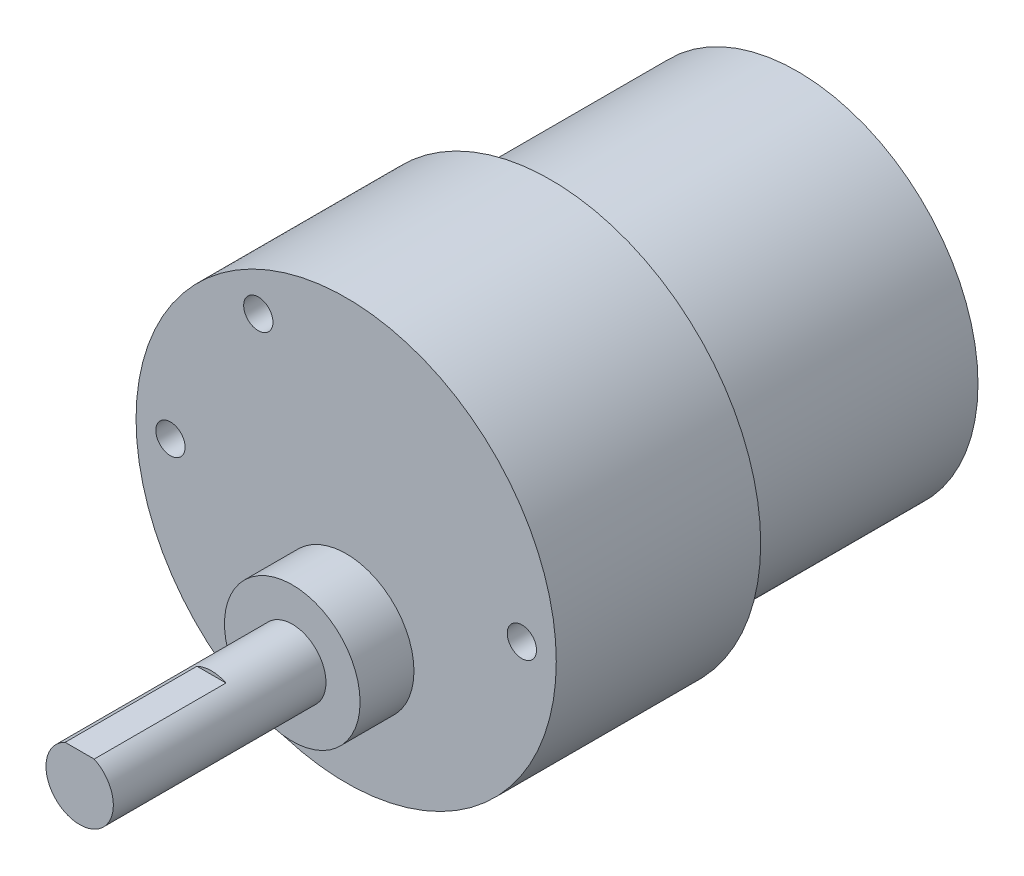
ISO-10303-21;
HEADER;
FILE_DESCRIPTION(('STEP AP214'),'2;1');
FILE_NAME('part.step','',(''),(''),'','','');
FILE_SCHEMA(('AUTOMOTIVE_DESIGN { 1 0 10303 214 1 1 1 1 }'));
ENDSEC;
DATA;
#1=APPLICATION_CONTEXT('core data for automotive mechanical design processes');
#2=APPLICATION_PROTOCOL_DEFINITION('international standard','automotive_design',2000,#1);
#3=PRODUCT_CONTEXT('',#1,'mechanical');
#4=PRODUCT('Part','Part','',(#3));
#5=PRODUCT_RELATED_PRODUCT_CATEGORY('part','',(#4));
#6=PRODUCT_DEFINITION_FORMATION('','',#4);
#7=PRODUCT_DEFINITION_CONTEXT('part definition',#1,'design');
#8=PRODUCT_DEFINITION('design','',#6,#7);
#9=PRODUCT_DEFINITION_SHAPE('','',#8);
#10=(LENGTH_UNIT() NAMED_UNIT(*) SI_UNIT(.MILLI.,.METRE.));
#11=(NAMED_UNIT(*) PLANE_ANGLE_UNIT() SI_UNIT($,.RADIAN.));
#12=(NAMED_UNIT(*) SI_UNIT($,.STERADIAN.) SOLID_ANGLE_UNIT());
#13=UNCERTAINTY_MEASURE_WITH_UNIT(LENGTH_MEASURE(1.E-05),#10,'distance_accuracy_value','');
#14=(GEOMETRIC_REPRESENTATION_CONTEXT(3) GLOBAL_UNCERTAINTY_ASSIGNED_CONTEXT((#13)) GLOBAL_UNIT_ASSIGNED_CONTEXT((#10,
#11,#12)) REPRESENTATION_CONTEXT('',''));
#15=CARTESIAN_POINT('',(0.,0.,0.));
#16=DIRECTION('',(0.,0.,1.));
#17=DIRECTION('',(1.,0.,0.));
#18=AXIS2_PLACEMENT_3D('',#15,#16,#17);
#19=CARTESIAN_POINT('',(0.,0.,0.));
#20=DIRECTION('',(0.,0.,1.));
#21=DIRECTION('',(1.,0.,0.));
#22=AXIS2_PLACEMENT_3D('',#19,#20,#21);
#23=PLANE('',#22);
#24=CARTESIAN_POINT('',(0.,0.,0.));
#25=DIRECTION('',(0.,0.,1.));
#26=DIRECTION('',(1.,0.,0.));
#27=AXIS2_PLACEMENT_3D('',#24,#25,#26);
#28=CIRCLE('',#27,15.6591);
#29=CARTESIAN_POINT('',(15.6591,0.,0.));
#30=VERTEX_POINT('',#29);
#31=EDGE_CURVE('E92',#30,#30,#28,.T.);
#32=ORIENTED_EDGE('',*,*,#31,.F.);
#33=EDGE_LOOP('',(#32));
#34=FACE_BOUND('',#33,.T.);
#35=CARTESIAN_POINT('',(0.,0.,0.));
#36=DIRECTION('',(0.,0.,1.));
#37=DIRECTION('',(1.,0.,0.));
#38=AXIS2_PLACEMENT_3D('',#35,#36,#37);
#39=CIRCLE('',#38,4.4577);
#40=CARTESIAN_POINT('',(4.4577,0.,0.));
#41=VERTEX_POINT('',#40);
#42=EDGE_CURVE('E11',#41,#41,#39,.F.);
#43=ORIENTED_EDGE('',*,*,#42,.F.);
#44=EDGE_LOOP('',(#43));
#45=FACE_BOUND('',#44,.T.);
#46=ADVANCED_FACE('F32',(#34,#45),#23,.F.);
#47=CARTESIAN_POINT('',(0.,-6.8834,43.815));
#48=DIRECTION('',(0.,0.,1.));
#49=DIRECTION('',(1.,0.,0.));
#50=AXIS2_PLACEMENT_3D('',#47,#48,#49);
#51=PLANE('',#50);
#52=CARTESIAN_POINT('',(0.,-6.8834,43.815));
#53=DIRECTION('',(0.,0.,1.));
#54=DIRECTION('',(1.,0.,0.));
#55=AXIS2_PLACEMENT_3D('',#52,#53,#54);
#56=CIRCLE('',#55,5.8801);
#57=CARTESIAN_POINT('',(5.8801,-6.8834,43.815));
#58=VERTEX_POINT('',#57);
#59=EDGE_CURVE('E77',#58,#58,#56,.T.);
#60=ORIENTED_EDGE('',*,*,#59,.T.);
#61=EDGE_LOOP('',(#60));
#62=FACE_BOUND('',#61,.T.);
#63=CARTESIAN_POINT('',(0.,-6.8834,43.815));
#64=DIRECTION('',(0.,0.,1.));
#65=DIRECTION('',(1.,0.,0.));
#66=AXIS2_PLACEMENT_3D('',#63,#64,#65);
#67=CIRCLE('',#66,2.921);
#68=CARTESIAN_POINT('',(2.921,-6.8834,43.815));
#69=VERTEX_POINT('',#68);
#70=EDGE_CURVE('E74',#69,#69,#67,.T.);
#71=ORIENTED_EDGE('',*,*,#70,.F.);
#72=EDGE_LOOP('',(#71));
#73=FACE_BOUND('',#72,.T.);
#74=ADVANCED_FACE('F106',(#62,#73),#51,.T.);
#75=CARTESIAN_POINT('',(0.,0.,39.1414));
#76=DIRECTION('',(0.,0.,1.));
#77=DIRECTION('',(1.,0.,0.));
#78=AXIS2_PLACEMENT_3D('',#75,#76,#77);
#79=PLANE('',#78);
#80=CARTESIAN_POINT('',(-7.61999995005214,13.1982271825123,39.1414));
#81=DIRECTION('',(0.,0.,1.));
#82=DIRECTION('',(1.,0.,0.));
#83=AXIS2_PLACEMENT_3D('',#80,#81,#82);
#84=CIRCLE('',#83,1.27);
#85=CARTESIAN_POINT('',(-6.34999995005214,13.1982271825123,39.1414));
#86=VERTEX_POINT('',#85);
#87=EDGE_CURVE('E275',#86,#86,#84,.T.);
#88=ORIENTED_EDGE('',*,*,#87,.F.);
#89=EDGE_LOOP('',(#88));
#90=FACE_BOUND('',#89,.T.);
#91=CARTESIAN_POINT('',(-7.62000000000006,-13.198227096,39.1414));
#92=DIRECTION('',(0.,0.,1.));
#93=DIRECTION('',(1.,0.,0.));
#94=AXIS2_PLACEMENT_3D('',#91,#92,#93);
#95=CIRCLE('',#94,1.27);
#96=CARTESIAN_POINT('',(-6.35000000000006,-13.198227096,39.1414));
#97=VERTEX_POINT('',#96);
#98=EDGE_CURVE('E281',#97,#97,#95,.T.);
#99=ORIENTED_EDGE('',*,*,#98,.F.);
#100=EDGE_LOOP('',(#99));
#101=FACE_BOUND('',#100,.T.);
#102=CARTESIAN_POINT('',(-15.24,0.,39.1414));
#103=DIRECTION('',(0.,0.,1.));
#104=DIRECTION('',(1.,0.,0.));
#105=AXIS2_PLACEMENT_3D('',#102,#103,#104);
#106=CIRCLE('',#105,1.27);
#107=CARTESIAN_POINT('',(-13.97,0.,39.1414));
#108=VERTEX_POINT('',#107);
#109=EDGE_CURVE('E287',#108,#108,#106,.T.);
#110=ORIENTED_EDGE('',*,*,#109,.F.);
#111=EDGE_LOOP('',(#110));
#112=FACE_BOUND('',#111,.T.);
#113=CARTESIAN_POINT('',(15.24,0.,39.1414));
#114=DIRECTION('',(0.,0.,1.));
#115=DIRECTION('',(1.,0.,0.));
#116=AXIS2_PLACEMENT_3D('',#113,#114,#115);
#117=CIRCLE('',#116,1.27);
#118=CARTESIAN_POINT('',(16.51,0.,39.1414));
#119=VERTEX_POINT('',#118);
#120=EDGE_CURVE('E293',#119,#119,#117,.T.);
#121=ORIENTED_EDGE('',*,*,#120,.F.);
#122=EDGE_LOOP('',(#121));
#123=FACE_BOUND('',#122,.T.);
#124=CARTESIAN_POINT('',(0.,0.,39.1414));
#125=DIRECTION('',(0.,0.,1.));
#126=DIRECTION('',(1.,0.,0.));
#127=AXIS2_PLACEMENT_3D('',#124,#125,#126);
#128=CIRCLE('',#127,18.2245);
#129=CARTESIAN_POINT('',(18.2245,0.,39.1414));
#130=VERTEX_POINT('',#129);
#131=EDGE_CURVE('E89',#130,#130,#128,.T.);
#132=ORIENTED_EDGE('',*,*,#131,.T.);
#133=EDGE_LOOP('',(#132));
#134=FACE_BOUND('',#133,.T.);
#135=CARTESIAN_POINT('',(0.,-6.8834,39.1414));
#136=DIRECTION('',(0.,0.,1.));
#137=DIRECTION('',(1.,0.,0.));
#138=AXIS2_PLACEMENT_3D('',#135,#136,#137);
#139=CIRCLE('',#138,5.8801);
#140=CARTESIAN_POINT('',(5.8801,-6.8834,39.1414));
#141=VERTEX_POINT('',#140);
#142=EDGE_CURVE('E73',#141,#141,#139,.T.);
#143=ORIENTED_EDGE('',*,*,#142,.F.);
#144=EDGE_LOOP('',(#143));
#145=FACE_BOUND('',#144,.T.);
#146=ADVANCED_FACE('F101',(#90,#101,#112,#123,#134,#145),#79,.T.);
#147=CARTESIAN_POINT('',(0.,0.,21.4122));
#148=DIRECTION('',(0.,0.,-1.));
#149=DIRECTION('',(-1.,0.,0.));
#150=AXIS2_PLACEMENT_3D('',#147,#148,#149);
#151=CYLINDRICAL_SURFACE('',#150,15.6591);
#152=CARTESIAN_POINT('',(0.,0.,21.4122));
#153=DIRECTION('',(0.,0.,1.));
#154=DIRECTION('',(1.,0.,0.));
#155=AXIS2_PLACEMENT_3D('',#152,#153,#154);
#156=CIRCLE('',#155,15.6591);
#157=CARTESIAN_POINT('',(15.6591,0.,21.4122));
#158=VERTEX_POINT('',#157);
#159=EDGE_CURVE('E40',#158,#158,#156,.T.);
#160=ORIENTED_EDGE('',*,*,#159,.F.);
#161=EDGE_LOOP('',(#160));
#162=FACE_BOUND('',#161,.T.);
#163=ORIENTED_EDGE('',*,*,#31,.T.);
#164=EDGE_LOOP('',(#163));
#165=FACE_BOUND('',#164,.T.);
#166=ADVANCED_FACE('F34',(#162,#165),#151,.T.);
#167=CARTESIAN_POINT('',(0.,0.,21.4122));
#168=DIRECTION('',(0.,0.,1.));
#169=DIRECTION('',(1.,0.,0.));
#170=AXIS2_PLACEMENT_3D('',#167,#168,#169);
#171=PLANE('',#170);
#172=CARTESIAN_POINT('',(0.,0.,21.4122));
#173=DIRECTION('',(0.,0.,1.));
#174=DIRECTION('',(1.,0.,0.));
#175=AXIS2_PLACEMENT_3D('',#172,#173,#174);
#176=CIRCLE('',#175,18.2245);
#177=CARTESIAN_POINT('',(18.2245,0.,21.4122));
#178=VERTEX_POINT('',#177);
#179=EDGE_CURVE('E86',#178,#178,#176,.T.);
#180=ORIENTED_EDGE('',*,*,#179,.F.);
#181=EDGE_LOOP('',(#180));
#182=FACE_BOUND('',#181,.T.);
#183=ORIENTED_EDGE('',*,*,#159,.T.);
#184=EDGE_LOOP('',(#183));
#185=FACE_BOUND('',#184,.T.);
#186=ADVANCED_FACE('F97',(#182,#185),#171,.F.);
#187=CARTESIAN_POINT('',(0.,0.,39.1414));
#188=DIRECTION('',(0.,0.,-1.));
#189=DIRECTION('',(-1.,0.,0.));
#190=AXIS2_PLACEMENT_3D('',#187,#188,#189);
#191=CYLINDRICAL_SURFACE('',#190,18.2245);
#192=ORIENTED_EDGE('',*,*,#131,.F.);
#193=EDGE_LOOP('',(#192));
#194=FACE_BOUND('',#193,.T.);
#195=ORIENTED_EDGE('',*,*,#179,.T.);
#196=EDGE_LOOP('',(#195));
#197=FACE_BOUND('',#196,.T.);
#198=ADVANCED_FACE('F164',(#194,#197),#191,.T.);
#199=CARTESIAN_POINT('',(0.,-6.8834,43.815));
#200=DIRECTION('',(0.,0.,-1.));
#201=DIRECTION('',(-1.,0.,0.));
#202=AXIS2_PLACEMENT_3D('',#199,#200,#201);
#203=CYLINDRICAL_SURFACE('',#202,5.8801);
#204=ORIENTED_EDGE('',*,*,#59,.F.);
#205=EDGE_LOOP('',(#204));
#206=FACE_BOUND('',#205,.T.);
#207=ORIENTED_EDGE('',*,*,#142,.T.);
#208=EDGE_LOOP('',(#207));
#209=FACE_BOUND('',#208,.T.);
#210=ADVANCED_FACE('F158',(#206,#209),#203,.T.);
#211=CARTESIAN_POINT('',(0.,-6.8834,62.2554));
#212=DIRECTION('',(0.,0.,-1.));
#213=DIRECTION('',(-1.,0.,0.));
#214=AXIS2_PLACEMENT_3D('',#211,#212,#213);
#215=CYLINDRICAL_SURFACE('',#214,2.921);
#216=CARTESIAN_POINT('',(0.,-6.8834,62.2554));
#217=DIRECTION('',(0.,0.,1.));
#218=DIRECTION('',(1.,0.,0.));
#219=AXIS2_PLACEMENT_3D('',#216,#217,#218);
#220=CIRCLE('',#219,2.921);
#221=CARTESIAN_POINT('',(-1.26003906189451,-4.24815,62.2554));
#222=VERTEX_POINT('',#221);
#223=CARTESIAN_POINT('',(1.26003906189451,-4.24815,62.2554));
#224=VERTEX_POINT('',#223);
#225=EDGE_CURVE('E69',#222,#224,#220,.T.);
#226=ORIENTED_EDGE('',*,*,#225,.F.);
#227=DIRECTION('',(0.,0.,1.));
#228=VECTOR('',#227,1.);
#229=CARTESIAN_POINT('',(-1.26003906189451,-4.24815,50.8254));
#230=LINE('',#229,#228);
#231=CARTESIAN_POINT('',(-1.26003906189451,-4.24815,50.8254));
#232=VERTEX_POINT('',#231);
#233=EDGE_CURVE('E47',#232,#222,#230,.T.);
#234=ORIENTED_EDGE('',*,*,#233,.F.);
#235=CARTESIAN_POINT('',(0.,-6.8834,50.8254));
#236=DIRECTION('',(0.,0.,1.));
#237=DIRECTION('',(1.,0.,0.));
#238=AXIS2_PLACEMENT_3D('',#235,#236,#237);
#239=CIRCLE('',#238,2.921);
#240=CARTESIAN_POINT('',(1.26003906189451,-4.24815,50.8254));
#241=VERTEX_POINT('',#240);
#242=EDGE_CURVE('E63',#241,#232,#239,.T.);
#243=ORIENTED_EDGE('',*,*,#242,.F.);
#244=DIRECTION('',(0.,0.,1.));
#245=VECTOR('',#244,1.);
#246=CARTESIAN_POINT('',(1.26003906189451,-4.24815,50.8254));
#247=LINE('',#246,#245);
#248=EDGE_CURVE('E52',#241,#224,#247,.T.);
#249=ORIENTED_EDGE('',*,*,#248,.T.);
#250=EDGE_LOOP('',(#226,#234,#243,#249));
#251=FACE_BOUND('',#250,.T.);
#252=ORIENTED_EDGE('',*,*,#70,.T.);
#253=EDGE_LOOP('',(#252));
#254=FACE_BOUND('',#253,.T.);
#255=ADVANCED_FACE('F67',(#251,#254),#215,.T.);
#256=CARTESIAN_POINT('',(0.,-6.8834,62.2554));
#257=DIRECTION('',(0.,0.,1.));
#258=DIRECTION('',(1.,0.,0.));
#259=AXIS2_PLACEMENT_3D('',#256,#257,#258);
#260=PLANE('',#259);
#261=DIRECTION('',(1.,0.,0.));
#262=VECTOR('',#261,1.);
#263=CARTESIAN_POINT('',(1.26003906189451,-4.24815,62.2554));
#264=LINE('',#263,#262);
#265=EDGE_CURVE('E58',#222,#224,#264,.T.);
#266=ORIENTED_EDGE('',*,*,#265,.F.);
#267=ORIENTED_EDGE('',*,*,#225,.T.);
#268=EDGE_LOOP('',(#266,#267));
#269=FACE_BOUND('',#268,.T.);
#270=ADVANCED_FACE('F72',(#269),#260,.T.);
#271=CARTESIAN_POINT('',(15.24,0.,29.7942));
#272=DIRECTION('',(0.,0.,1.));
#273=DIRECTION('',(1.,0.,0.));
#274=AXIS2_PLACEMENT_3D('',#271,#272,#273);
#275=CYLINDRICAL_SURFACE('',#274,1.27);
#276=CARTESIAN_POINT('',(15.24,0.,29.7942));
#277=DIRECTION('',(0.,0.,1.));
#278=DIRECTION('',(1.,0.,0.));
#279=AXIS2_PLACEMENT_3D('',#276,#277,#278);
#280=CIRCLE('',#279,1.27);
#281=CARTESIAN_POINT('',(16.51,0.,29.7942));
#282=VERTEX_POINT('',#281);
#283=EDGE_CURVE('E80',#282,#282,#280,.T.);
#284=ORIENTED_EDGE('',*,*,#283,.F.);
#285=EDGE_LOOP('',(#284));
#286=FACE_BOUND('',#285,.T.);
#287=ORIENTED_EDGE('',*,*,#120,.T.);
#288=EDGE_LOOP('',(#287));
#289=FACE_BOUND('',#288,.T.);
#290=ADVANCED_FACE('F149',(#286,#289),#275,.F.);
#291=CARTESIAN_POINT('',(15.24,0.,29.7942));
#292=DIRECTION('',(0.,0.,1.));
#293=DIRECTION('',(1.,0.,0.));
#294=AXIS2_PLACEMENT_3D('',#291,#292,#293);
#295=PLANE('',#294);
#296=ORIENTED_EDGE('',*,*,#283,.T.);
#297=EDGE_LOOP('',(#296));
#298=FACE_BOUND('',#297,.T.);
#299=ADVANCED_FACE('F145',(#298),#295,.T.);
#300=CARTESIAN_POINT('',(-15.24,0.,29.7942));
#301=DIRECTION('',(0.,0.,1.));
#302=DIRECTION('',(1.,0.,0.));
#303=AXIS2_PLACEMENT_3D('',#300,#301,#302);
#304=CYLINDRICAL_SURFACE('',#303,1.27);
#305=CARTESIAN_POINT('',(-15.24,0.,29.7942));
#306=DIRECTION('',(0.,0.,1.));
#307=DIRECTION('',(1.,0.,0.));
#308=AXIS2_PLACEMENT_3D('',#305,#306,#307);
#309=CIRCLE('',#308,1.27);
#310=CARTESIAN_POINT('',(-13.97,0.,29.7942));
#311=VERTEX_POINT('',#310);
#312=EDGE_CURVE('E290',#311,#311,#309,.T.);
#313=ORIENTED_EDGE('',*,*,#312,.F.);
#314=EDGE_LOOP('',(#313));
#315=FACE_BOUND('',#314,.T.);
#316=ORIENTED_EDGE('',*,*,#109,.T.);
#317=EDGE_LOOP('',(#316));
#318=FACE_BOUND('',#317,.T.);
#319=ADVANCED_FACE('F141',(#315,#318),#304,.F.);
#320=CARTESIAN_POINT('',(-15.24,0.,29.7942));
#321=DIRECTION('',(0.,0.,1.));
#322=DIRECTION('',(1.,0.,0.));
#323=AXIS2_PLACEMENT_3D('',#320,#321,#322);
#324=PLANE('',#323);
#325=ORIENTED_EDGE('',*,*,#312,.T.);
#326=EDGE_LOOP('',(#325));
#327=FACE_BOUND('',#326,.T.);
#328=ADVANCED_FACE('F137',(#327),#324,.T.);
#329=CARTESIAN_POINT('',(-7.62000000000006,-13.198227096,29.7942));
#330=DIRECTION('',(0.,0.,1.));
#331=DIRECTION('',(1.,0.,0.));
#332=AXIS2_PLACEMENT_3D('',#329,#330,#331);
#333=CYLINDRICAL_SURFACE('',#332,1.27);
#334=CARTESIAN_POINT('',(-7.62000000000006,-13.198227096,29.7942));
#335=DIRECTION('',(0.,0.,1.));
#336=DIRECTION('',(1.,0.,0.));
#337=AXIS2_PLACEMENT_3D('',#334,#335,#336);
#338=CIRCLE('',#337,1.27);
#339=CARTESIAN_POINT('',(-6.35000000000006,-13.198227096,29.7942));
#340=VERTEX_POINT('',#339);
#341=EDGE_CURVE('E284',#340,#340,#338,.T.);
#342=ORIENTED_EDGE('',*,*,#341,.F.);
#343=EDGE_LOOP('',(#342));
#344=FACE_BOUND('',#343,.T.);
#345=ORIENTED_EDGE('',*,*,#98,.T.);
#346=EDGE_LOOP('',(#345));
#347=FACE_BOUND('',#346,.T.);
#348=ADVANCED_FACE('F133',(#344,#347),#333,.F.);
#349=CARTESIAN_POINT('',(-7.62000000000006,-13.198227096,29.7942));
#350=DIRECTION('',(0.,0.,1.));
#351=DIRECTION('',(1.,0.,0.));
#352=AXIS2_PLACEMENT_3D('',#349,#350,#351);
#353=PLANE('',#352);
#354=ORIENTED_EDGE('',*,*,#341,.T.);
#355=EDGE_LOOP('',(#354));
#356=FACE_BOUND('',#355,.T.);
#357=ADVANCED_FACE('F129',(#356),#353,.T.);
#358=CARTESIAN_POINT('',(-7.61999995005214,13.1982271825123,29.7942));
#359=DIRECTION('',(0.,0.,1.));
#360=DIRECTION('',(1.,0.,0.));
#361=AXIS2_PLACEMENT_3D('',#358,#359,#360);
#362=CYLINDRICAL_SURFACE('',#361,1.27);
#363=CARTESIAN_POINT('',(-7.61999995005214,13.1982271825123,29.7942));
#364=DIRECTION('',(0.,0.,1.));
#365=DIRECTION('',(1.,0.,0.));
#366=AXIS2_PLACEMENT_3D('',#363,#364,#365);
#367=CIRCLE('',#366,1.27);
#368=CARTESIAN_POINT('',(-6.34999995005214,13.1982271825123,29.7942));
#369=VERTEX_POINT('',#368);
#370=EDGE_CURVE('E278',#369,#369,#367,.T.);
#371=ORIENTED_EDGE('',*,*,#370,.F.);
#372=EDGE_LOOP('',(#371));
#373=FACE_BOUND('',#372,.T.);
#374=ORIENTED_EDGE('',*,*,#87,.T.);
#375=EDGE_LOOP('',(#374));
#376=FACE_BOUND('',#375,.T.);
#377=ADVANCED_FACE('F121',(#373,#376),#362,.F.);
#378=CARTESIAN_POINT('',(-7.61999995005214,13.1982271825123,29.7942));
#379=DIRECTION('',(0.,0.,1.));
#380=DIRECTION('',(1.,0.,0.));
#381=AXIS2_PLACEMENT_3D('',#378,#379,#380);
#382=PLANE('',#381);
#383=ORIENTED_EDGE('',*,*,#370,.T.);
#384=EDGE_LOOP('',(#383));
#385=FACE_BOUND('',#384,.T.);
#386=ADVANCED_FACE('F112',(#385),#382,.T.);
#387=CARTESIAN_POINT('',(0.,0.,-2.921));
#388=DIRECTION('',(0.,0.,1.));
#389=DIRECTION('',(1.,0.,0.));
#390=AXIS2_PLACEMENT_3D('',#387,#388,#389);
#391=CYLINDRICAL_SURFACE('',#390,4.4577);
#392=CARTESIAN_POINT('',(0.,0.,-2.921));
#393=DIRECTION('',(0.,0.,-1.));
#394=DIRECTION('',(-1.,0.,0.));
#395=AXIS2_PLACEMENT_3D('',#392,#393,#394);
#396=CIRCLE('',#395,4.4577);
#397=CARTESIAN_POINT('',(-4.4577,0.,-2.921));
#398=VERTEX_POINT('',#397);
#399=EDGE_CURVE('E70',#398,#398,#396,.T.);
#400=ORIENTED_EDGE('',*,*,#399,.F.);
#401=EDGE_LOOP('',(#400));
#402=FACE_BOUND('',#401,.T.);
#403=ORIENTED_EDGE('',*,*,#42,.T.);
#404=EDGE_LOOP('',(#403));
#405=FACE_BOUND('',#404,.T.);
#406=ADVANCED_FACE('F109',(#402,#405),#391,.T.);
#407=CARTESIAN_POINT('',(0.,0.,-2.921));
#408=DIRECTION('',(0.,0.,-1.));
#409=DIRECTION('',(-1.,0.,0.));
#410=AXIS2_PLACEMENT_3D('',#407,#408,#409);
#411=PLANE('',#410);
#412=ORIENTED_EDGE('',*,*,#399,.T.);
#413=EDGE_LOOP('',(#412));
#414=FACE_BOUND('',#413,.T.);
#415=ADVANCED_FACE('F111',(#414),#411,.T.);
#416=CARTESIAN_POINT('',(1.26003906189451,-4.24815,50.8254));
#417=DIRECTION('',(0.,-1.,0.));
#418=DIRECTION('',(0.,0.,-1.));
#419=AXIS2_PLACEMENT_3D('',#416,#417,#418);
#420=PLANE('',#419);
#421=ORIENTED_EDGE('',*,*,#265,.T.);
#422=ORIENTED_EDGE('',*,*,#248,.F.);
#423=DIRECTION('',(1.,0.,0.));
#424=VECTOR('',#423,1.);
#425=CARTESIAN_POINT('',(1.26003906189451,-4.24815,50.8254));
#426=LINE('',#425,#424);
#427=EDGE_CURVE('E268',#232,#241,#426,.T.);
#428=ORIENTED_EDGE('',*,*,#427,.F.);
#429=ORIENTED_EDGE('',*,*,#233,.T.);
#430=EDGE_LOOP('',(#421,#422,#428,#429));
#431=FACE_BOUND('',#430,.T.);
#432=ADVANCED_FACE('F59',(#431),#420,.F.);
#433=CARTESIAN_POINT('',(0.,-6.8834,50.8254));
#434=DIRECTION('',(0.,0.,1.));
#435=DIRECTION('',(1.,0.,0.));
#436=AXIS2_PLACEMENT_3D('',#433,#434,#435);
#437=PLANE('',#436);
#438=ORIENTED_EDGE('',*,*,#242,.T.);
#439=ORIENTED_EDGE('',*,*,#427,.T.);
#440=EDGE_LOOP('',(#438,#439));
#441=FACE_BOUND('',#440,.T.);
#442=ADVANCED_FACE('F256',(#441),#437,.T.);
#443=CLOSED_SHELL('',(#46,#74,#146,#166,#186,#198,#210,#255,#270,#290,#299,#319,#328,#348,#357,
#377,#386,#406,#415,#432,#442));
#444=MANIFOLD_SOLID_BREP('B2',#443);
#445=ADVANCED_BREP_SHAPE_REPRESENTATION('',(#18,#444),#14);
#446=SHAPE_DEFINITION_REPRESENTATION(#9,#445);
ENDSEC;
END-ISO-10303-21;
